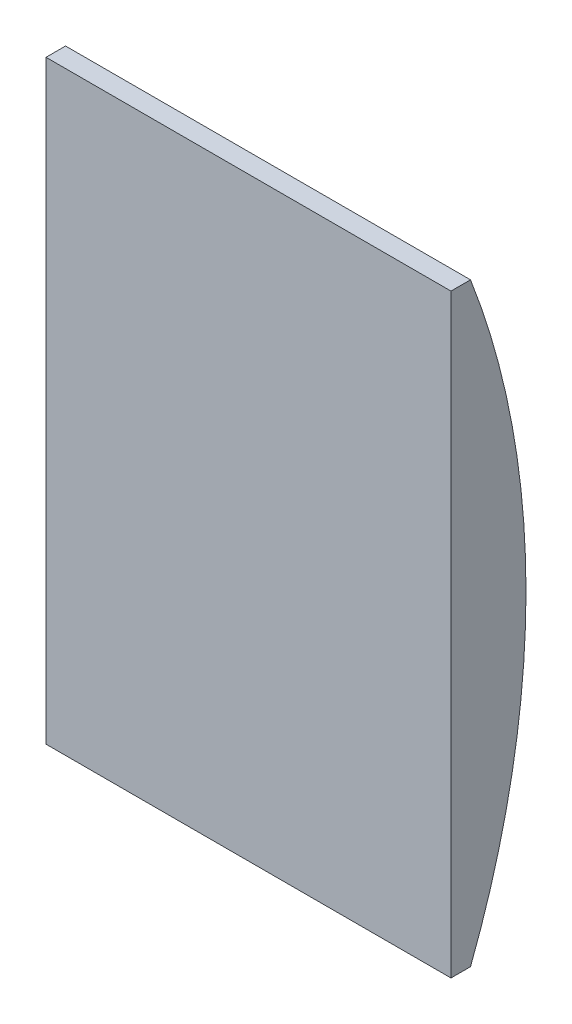
ISO-10303-21;
HEADER;
FILE_DESCRIPTION(('STEP AP214'),'2;1');
FILE_NAME('part.step','',(''),(''),'','','');
FILE_SCHEMA(('AUTOMOTIVE_DESIGN { 1 0 10303 214 1 1 1 1 }'));
ENDSEC;
DATA;
#1=APPLICATION_CONTEXT('core data for automotive mechanical design processes');
#2=APPLICATION_PROTOCOL_DEFINITION('international standard','automotive_design',2000,#1);
#3=PRODUCT_CONTEXT('',#1,'mechanical');
#4=PRODUCT('Part','Part','',(#3));
#5=PRODUCT_RELATED_PRODUCT_CATEGORY('part','',(#4));
#6=PRODUCT_DEFINITION_FORMATION('','',#4);
#7=PRODUCT_DEFINITION_CONTEXT('part definition',#1,'design');
#8=PRODUCT_DEFINITION('design','',#6,#7);
#9=PRODUCT_DEFINITION_SHAPE('','',#8);
#10=(LENGTH_UNIT() NAMED_UNIT(*) SI_UNIT(.MILLI.,.METRE.));
#11=(NAMED_UNIT(*) PLANE_ANGLE_UNIT() SI_UNIT($,.RADIAN.));
#12=(NAMED_UNIT(*) SI_UNIT($,.STERADIAN.) SOLID_ANGLE_UNIT());
#13=UNCERTAINTY_MEASURE_WITH_UNIT(LENGTH_MEASURE(1.E-05),#10,'distance_accuracy_value','');
#14=(GEOMETRIC_REPRESENTATION_CONTEXT(3) GLOBAL_UNCERTAINTY_ASSIGNED_CONTEXT((#13)) GLOBAL_UNIT_ASSIGNED_CONTEXT((#10,
#11,#12)) REPRESENTATION_CONTEXT('',''));
#15=CARTESIAN_POINT('',(0.,0.,0.));
#16=DIRECTION('',(0.,0.,1.));
#17=DIRECTION('',(1.,0.,0.));
#18=AXIS2_PLACEMENT_3D('',#15,#16,#17);
#19=CARTESIAN_POINT('',(64.5795,0.,0.));
#20=DIRECTION('',(0.,0.,-1.));
#21=DIRECTION('',(-1.,0.,0.));
#22=AXIS2_PLACEMENT_3D('',#19,#20,#21);
#23=PLANE('',#22);
#24=DIRECTION('',(0.,-1.,0.));
#25=VECTOR('',#24,1.);
#26=CARTESIAN_POINT('',(0.,0.,0.));
#27=LINE('',#26,#25);
#28=CARTESIAN_POINT('',(0.,94.869,0.));
#29=VERTEX_POINT('',#28);
#30=CARTESIAN_POINT('',(0.,0.,0.));
#31=VERTEX_POINT('',#30);
#32=EDGE_CURVE('E96',#29,#31,#27,.T.);
#33=ORIENTED_EDGE('',*,*,#32,.T.);
#34=DIRECTION('',(-1.,0.,0.));
#35=VECTOR('',#34,1.);
#36=CARTESIAN_POINT('',(64.5795,0.,0.));
#37=LINE('',#36,#35);
#38=CARTESIAN_POINT('',(64.5795,0.,0.));
#39=VERTEX_POINT('',#38);
#40=EDGE_CURVE('E11',#39,#31,#37,.T.);
#41=ORIENTED_EDGE('',*,*,#40,.F.);
#42=DIRECTION('',(0.,-1.,0.));
#43=VECTOR('',#42,1.);
#44=CARTESIAN_POINT('',(64.5795,0.,0.));
#45=LINE('',#44,#43);
#46=CARTESIAN_POINT('',(64.5795,94.869,0.));
#47=VERTEX_POINT('',#46);
#48=EDGE_CURVE('E84',#47,#39,#45,.T.);
#49=ORIENTED_EDGE('',*,*,#48,.F.);
#50=DIRECTION('',(-1.,0.,0.));
#51=VECTOR('',#50,1.);
#52=CARTESIAN_POINT('',(64.5795,94.869,0.));
#53=LINE('',#52,#51);
#54=EDGE_CURVE('E92',#47,#29,#53,.T.);
#55=ORIENTED_EDGE('',*,*,#54,.T.);
#56=EDGE_LOOP('',(#33,#41,#49,#55));
#57=FACE_BOUND('',#56,.T.);
#58=ADVANCED_FACE('F33',(#57),#23,.F.);
#59=CARTESIAN_POINT('',(64.5795,0.,0.));
#60=DIRECTION('',(0.,1.,0.));
#61=DIRECTION('',(0.,0.,1.));
#62=AXIS2_PLACEMENT_3D('',#59,#60,#61);
#63=PLANE('',#62);
#64=DIRECTION('',(0.,0.,-1.));
#65=VECTOR('',#64,1.);
#66=CARTESIAN_POINT('',(0.,0.,0.));
#67=LINE('',#66,#65);
#68=CARTESIAN_POINT('',(0.,0.,-3.11404));
#69=VERTEX_POINT('',#68);
#70=EDGE_CURVE('E88',#31,#69,#67,.T.);
#71=ORIENTED_EDGE('',*,*,#70,.T.);
#72=DIRECTION('',(-1.,0.,0.));
#73=VECTOR('',#72,1.);
#74=CARTESIAN_POINT('',(64.5795,0.,-3.11404));
#75=LINE('',#74,#73);
#76=CARTESIAN_POINT('',(64.5795,0.,-3.11404));
#77=VERTEX_POINT('',#76);
#78=EDGE_CURVE('E41',#77,#69,#75,.T.);
#79=ORIENTED_EDGE('',*,*,#78,.F.);
#80=DIRECTION('',(0.,0.,-1.));
#81=VECTOR('',#80,1.);
#82=CARTESIAN_POINT('',(64.5795,0.,0.));
#83=LINE('',#82,#81);
#84=EDGE_CURVE('E79',#39,#77,#83,.T.);
#85=ORIENTED_EDGE('',*,*,#84,.F.);
#86=ORIENTED_EDGE('',*,*,#40,.T.);
#87=EDGE_LOOP('',(#71,#79,#85,#86));
#88=FACE_BOUND('',#87,.T.);
#89=ADVANCED_FACE('F87',(#88),#63,.F.);
#90=CARTESIAN_POINT('',(64.5795,47.4345,119.62868372093));
#91=DIRECTION('',(-1.,0.,0.));
#92=DIRECTION('',(0.,0.,1.));
#93=AXIS2_PLACEMENT_3D('',#90,#91,#92);
#94=CYLINDRICAL_SURFACE('',#93,131.58954372093);
#95=CARTESIAN_POINT('',(0.,47.4345,119.62868372093));
#96=DIRECTION('',(1.,0.,0.));
#97=DIRECTION('',(0.,0.,1.));
#98=AXIS2_PLACEMENT_3D('',#95,#96,#97);
#99=CIRCLE('',#98,131.58954372093);
#100=CARTESIAN_POINT('',(0.,94.869,-3.11404));
#101=VERTEX_POINT('',#100);
#102=EDGE_CURVE('E66',#69,#101,#99,.T.);
#103=ORIENTED_EDGE('',*,*,#102,.T.);
#104=DIRECTION('',(-1.,0.,0.));
#105=VECTOR('',#104,1.);
#106=CARTESIAN_POINT('',(64.5795,94.869,-3.11404));
#107=LINE('',#106,#105);
#108=CARTESIAN_POINT('',(64.5795,94.869,-3.11404));
#109=VERTEX_POINT('',#108);
#110=EDGE_CURVE('E89',#109,#101,#107,.T.);
#111=ORIENTED_EDGE('',*,*,#110,.F.);
#112=CARTESIAN_POINT('',(64.5795,47.4345,119.62868372093));
#113=DIRECTION('',(1.,0.,0.));
#114=DIRECTION('',(0.,0.,1.));
#115=AXIS2_PLACEMENT_3D('',#112,#113,#114);
#116=CIRCLE('',#115,131.58954372093);
#117=EDGE_CURVE('E82',#77,#109,#116,.T.);
#118=ORIENTED_EDGE('',*,*,#117,.F.);
#119=ORIENTED_EDGE('',*,*,#78,.T.);
#120=EDGE_LOOP('',(#103,#111,#118,#119));
#121=FACE_BOUND('',#120,.T.);
#122=ADVANCED_FACE('F90',(#121),#94,.T.);
#123=CARTESIAN_POINT('',(64.5795,94.869,0.));
#124=DIRECTION('',(0.,-1.,0.));
#125=DIRECTION('',(0.,0.,-1.));
#126=AXIS2_PLACEMENT_3D('',#123,#124,#125);
#127=PLANE('',#126);
#128=DIRECTION('',(0.,0.,1.));
#129=VECTOR('',#128,1.);
#130=CARTESIAN_POINT('',(0.,94.869,0.));
#131=LINE('',#130,#129);
#132=EDGE_CURVE('E72',#101,#29,#131,.T.);
#133=ORIENTED_EDGE('',*,*,#132,.T.);
#134=ORIENTED_EDGE('',*,*,#54,.F.);
#135=DIRECTION('',(0.,0.,1.));
#136=VECTOR('',#135,1.);
#137=CARTESIAN_POINT('',(64.5795,94.869,0.));
#138=LINE('',#137,#136);
#139=EDGE_CURVE('E49',#109,#47,#138,.T.);
#140=ORIENTED_EDGE('',*,*,#139,.F.);
#141=ORIENTED_EDGE('',*,*,#110,.T.);
#142=EDGE_LOOP('',(#133,#134,#140,#141));
#143=FACE_BOUND('',#142,.T.);
#144=ADVANCED_FACE('F103',(#143),#127,.F.);
#145=CARTESIAN_POINT('',(64.5795,47.4345,119.62868372093));
#146=DIRECTION('',(-1.,0.,0.));
#147=DIRECTION('',(0.,0.,1.));
#148=AXIS2_PLACEMENT_3D('',#145,#146,#147);
#149=PLANE('',#148);
#150=ORIENTED_EDGE('',*,*,#48,.T.);
#151=ORIENTED_EDGE('',*,*,#84,.T.);
#152=ORIENTED_EDGE('',*,*,#117,.T.);
#153=ORIENTED_EDGE('',*,*,#139,.T.);
#154=EDGE_LOOP('',(#150,#151,#152,#153));
#155=FACE_BOUND('',#154,.T.);
#156=ADVANCED_FACE('F80',(#155),#149,.F.);
#157=CARTESIAN_POINT('',(0.,47.4345,119.62868372093));
#158=DIRECTION('',(-1.,0.,0.));
#159=DIRECTION('',(0.,0.,1.));
#160=AXIS2_PLACEMENT_3D('',#157,#158,#159);
#161=PLANE('',#160);
#162=ORIENTED_EDGE('',*,*,#32,.F.);
#163=ORIENTED_EDGE('',*,*,#132,.F.);
#164=ORIENTED_EDGE('',*,*,#102,.F.);
#165=ORIENTED_EDGE('',*,*,#70,.F.);
#166=EDGE_LOOP('',(#162,#163,#164,#165));
#167=FACE_BOUND('',#166,.T.);
#168=ADVANCED_FACE('F106',(#167),#161,.T.);
#169=CLOSED_SHELL('',(#58,#89,#122,#144,#156,#168));
#170=MANIFOLD_SOLID_BREP('B2',#169);
#171=ADVANCED_BREP_SHAPE_REPRESENTATION('',(#18,#170),#14);
#172=SHAPE_DEFINITION_REPRESENTATION(#9,#171);
ENDSEC;
END-ISO-10303-21;
